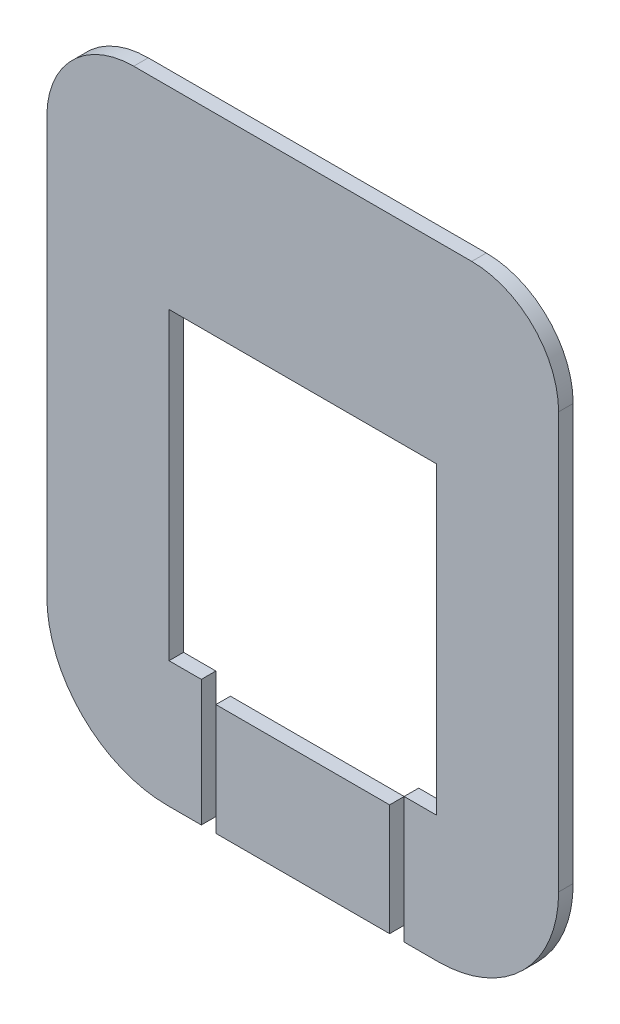
ISO-10303-21;
HEADER;
FILE_DESCRIPTION(('STEP AP214'),'2;1');
FILE_NAME('part.step','',(''),(''),'','','');
FILE_SCHEMA(('AUTOMOTIVE_DESIGN { 1 0 10303 214 1 1 1 1 }'));
ENDSEC;
DATA;
#1=APPLICATION_CONTEXT('core data for automotive mechanical design processes');
#2=APPLICATION_PROTOCOL_DEFINITION('international standard','automotive_design',2000,#1);
#3=PRODUCT_CONTEXT('',#1,'mechanical');
#4=PRODUCT('Part','Part','',(#3));
#5=PRODUCT_RELATED_PRODUCT_CATEGORY('part','',(#4));
#6=PRODUCT_DEFINITION_FORMATION('','',#4);
#7=PRODUCT_DEFINITION_CONTEXT('part definition',#1,'design');
#8=PRODUCT_DEFINITION('design','',#6,#7);
#9=PRODUCT_DEFINITION_SHAPE('','',#8);
#10=(LENGTH_UNIT() NAMED_UNIT(*) SI_UNIT(.MILLI.,.METRE.));
#11=(NAMED_UNIT(*) PLANE_ANGLE_UNIT() SI_UNIT($,.RADIAN.));
#12=(NAMED_UNIT(*) SI_UNIT($,.STERADIAN.) SOLID_ANGLE_UNIT());
#13=UNCERTAINTY_MEASURE_WITH_UNIT(LENGTH_MEASURE(1.E-05),#10,'distance_accuracy_value','');
#14=(GEOMETRIC_REPRESENTATION_CONTEXT(3) GLOBAL_UNCERTAINTY_ASSIGNED_CONTEXT((#13)) GLOBAL_UNIT_ASSIGNED_CONTEXT((#10,
#11,#12)) REPRESENTATION_CONTEXT('',''));
#15=CARTESIAN_POINT('',(0.,0.,0.));
#16=DIRECTION('',(0.,0.,1.));
#17=DIRECTION('',(1.,0.,0.));
#18=AXIS2_PLACEMENT_3D('',#15,#16,#17);
#19=CARTESIAN_POINT('',(-40.,-92.2,4.3));
#20=DIRECTION('',(0.,1.,0.));
#21=DIRECTION('',(-1.,0.,0.));
#22=AXIS2_PLACEMENT_3D('',#19,#20,#21);
#23=PLANE('',#22);
#24=DIRECTION('',(0.,0.,1.));
#25=VECTOR('',#24,1.);
#26=CARTESIAN_POINT('',(30.,-92.2,-5.7));
#27=LINE('',#26,#25);
#28=CARTESIAN_POINT('',(30.,-92.2,0.));
#29=VERTEX_POINT('',#28);
#30=CARTESIAN_POINT('',(30.,-92.2,4.3));
#31=VERTEX_POINT('',#30);
#32=EDGE_CURVE('E292',#29,#31,#27,.T.);
#33=ORIENTED_EDGE('',*,*,#32,.F.);
#34=DIRECTION('',(1.,0.,0.));
#35=VECTOR('',#34,1.);
#36=CARTESIAN_POINT('',(-40.,-92.2,0.));
#37=LINE('',#36,#35);
#38=CARTESIAN_POINT('',(40.,-92.2,0.));
#39=VERTEX_POINT('',#38);
#40=EDGE_CURVE('E302',#29,#39,#37,.T.);
#41=ORIENTED_EDGE('',*,*,#40,.T.);
#42=DIRECTION('',(0.,0.,-1.));
#43=VECTOR('',#42,1.);
#44=CARTESIAN_POINT('',(40.,-92.2,4.3));
#45=LINE('',#44,#43);
#46=CARTESIAN_POINT('',(40.,-92.2,4.3));
#47=VERTEX_POINT('',#46);
#48=EDGE_CURVE('E203',#47,#39,#45,.T.);
#49=ORIENTED_EDGE('',*,*,#48,.F.);
#50=DIRECTION('',(1.,0.,0.));
#51=VECTOR('',#50,1.);
#52=CARTESIAN_POINT('',(-0.49999999999998,-92.2,4.3));
#53=LINE('',#52,#51);
#54=EDGE_CURVE('E281',#31,#47,#53,.T.);
#55=ORIENTED_EDGE('',*,*,#54,.F.);
#56=EDGE_LOOP('',(#33,#41,#49,#55));
#57=FACE_BOUND('',#56,.T.);
#58=ADVANCED_FACE('F48',(#57),#23,.F.);
#59=CARTESIAN_POINT('',(40.,-56.5,4.3));
#60=DIRECTION('',(0.,0.,1.));
#61=DIRECTION('',(1.,0.,0.));
#62=AXIS2_PLACEMENT_3D('',#59,#60,#61);
#63=PLANE('',#62);
#64=DIRECTION('',(1.,0.,0.));
#65=VECTOR('',#64,1.);
#66=CARTESIAN_POINT('',(0.,-54.89,4.3));
#67=LINE('',#66,#65);
#68=CARTESIAN_POINT('',(30.,-54.89,4.3));
#69=VERTEX_POINT('',#68);
#70=CARTESIAN_POINT('',(39.555,-54.89,4.3));
#71=VERTEX_POINT('',#70);
#72=EDGE_CURVE('E202',#69,#71,#67,.T.);
#73=ORIENTED_EDGE('',*,*,#72,.F.);
#74=DIRECTION('',(0.,-1.,0.));
#75=VECTOR('',#74,1.);
#76=CARTESIAN_POINT('',(30.,0.,4.3));
#77=LINE('',#76,#75);
#78=EDGE_CURVE('E298',#69,#31,#77,.T.);
#79=ORIENTED_EDGE('',*,*,#78,.T.);
#80=ORIENTED_EDGE('',*,*,#54,.T.);
#81=CARTESIAN_POINT('',(40.,-56.5,4.3));
#82=DIRECTION('',(0.,0.,1.));
#83=DIRECTION('',(1.,0.,0.));
#84=AXIS2_PLACEMENT_3D('',#81,#82,#83);
#85=CIRCLE('',#84,35.7);
#86=CARTESIAN_POINT('',(75.7,-56.5,4.3));
#87=VERTEX_POINT('',#86);
#88=EDGE_CURVE('E278',#47,#87,#85,.T.);
#89=ORIENTED_EDGE('',*,*,#88,.T.);
#90=DIRECTION('',(0.,1.,0.));
#91=VECTOR('',#90,1.);
#92=CARTESIAN_POINT('',(75.7,66.5,4.3));
#93=LINE('',#92,#91);
#94=CARTESIAN_POINT('',(75.7,66.5,4.3));
#95=VERTEX_POINT('',#94);
#96=EDGE_CURVE('E275',#87,#95,#93,.T.);
#97=ORIENTED_EDGE('',*,*,#96,.T.);
#98=CARTESIAN_POINT('',(50.,66.5,4.3));
#99=DIRECTION('',(0.,0.,1.));
#100=DIRECTION('',(-1.,0.,0.));
#101=AXIS2_PLACEMENT_3D('',#98,#99,#100);
#102=CIRCLE('',#101,25.7);
#103=CARTESIAN_POINT('',(50.,92.2,4.3));
#104=VERTEX_POINT('',#103);
#105=EDGE_CURVE('E272',#95,#104,#102,.T.);
#106=ORIENTED_EDGE('',*,*,#105,.T.);
#107=DIRECTION('',(-1.,0.,0.));
#108=VECTOR('',#107,1.);
#109=CARTESIAN_POINT('',(-50.,92.2,4.3));
#110=LINE('',#109,#108);
#111=CARTESIAN_POINT('',(-50.,92.2,4.3));
#112=VERTEX_POINT('',#111);
#113=EDGE_CURVE('E269',#104,#112,#110,.T.);
#114=ORIENTED_EDGE('',*,*,#113,.T.);
#115=CARTESIAN_POINT('',(-50.,66.5,4.3));
#116=DIRECTION('',(0.,0.,1.));
#117=DIRECTION('',(-1.,0.,0.));
#118=AXIS2_PLACEMENT_3D('',#115,#116,#117);
#119=CIRCLE('',#118,25.7);
#120=CARTESIAN_POINT('',(-75.7,66.5,4.3));
#121=VERTEX_POINT('',#120);
#122=EDGE_CURVE('E266',#112,#121,#119,.T.);
#123=ORIENTED_EDGE('',*,*,#122,.T.);
#124=DIRECTION('',(0.,-1.,0.));
#125=VECTOR('',#124,1.);
#126=CARTESIAN_POINT('',(-75.7,66.5,4.3));
#127=LINE('',#126,#125);
#128=CARTESIAN_POINT('',(-75.7,-56.5,4.3));
#129=VERTEX_POINT('',#128);
#130=EDGE_CURVE('E263',#121,#129,#127,.T.);
#131=ORIENTED_EDGE('',*,*,#130,.T.);
#132=CARTESIAN_POINT('',(-40.,-56.5,4.3));
#133=DIRECTION('',(0.,0.,1.));
#134=DIRECTION('',(1.,0.,0.));
#135=AXIS2_PLACEMENT_3D('',#132,#133,#134);
#136=CIRCLE('',#135,35.7);
#137=CARTESIAN_POINT('',(-40.,-92.2,4.3));
#138=VERTEX_POINT('',#137);
#139=EDGE_CURVE('E258',#129,#138,#136,.T.);
#140=ORIENTED_EDGE('',*,*,#139,.T.);
#141=CARTESIAN_POINT('',(-30.,-92.2,4.3));
#142=VERTEX_POINT('',#141);
#143=EDGE_CURVE('E262',#138,#142,#53,.T.);
#144=ORIENTED_EDGE('',*,*,#143,.T.);
#145=DIRECTION('',(0.,-1.,0.));
#146=VECTOR('',#145,1.);
#147=CARTESIAN_POINT('',(-30.,0.,4.3));
#148=LINE('',#147,#146);
#149=CARTESIAN_POINT('',(-30.,-54.89,4.3));
#150=VERTEX_POINT('',#149);
#151=EDGE_CURVE('E288',#150,#142,#148,.T.);
#152=ORIENTED_EDGE('',*,*,#151,.F.);
#153=CARTESIAN_POINT('',(-39.555,-54.89,4.3));
#154=VERTEX_POINT('',#153);
#155=EDGE_CURVE('E184',#154,#150,#67,.T.);
#156=ORIENTED_EDGE('',*,*,#155,.F.);
#157=DIRECTION('',(0.,-1.,0.));
#158=VECTOR('',#157,1.);
#159=CARTESIAN_POINT('',(-39.555,0.,4.3));
#160=LINE('',#159,#158);
#161=CARTESIAN_POINT('',(-39.555,35.11,4.3));
#162=VERTEX_POINT('',#161);
#163=EDGE_CURVE('E181',#162,#154,#160,.T.);
#164=ORIENTED_EDGE('',*,*,#163,.F.);
#165=DIRECTION('',(1.,0.,0.));
#166=VECTOR('',#165,1.);
#167=CARTESIAN_POINT('',(0.,35.11,4.3));
#168=LINE('',#167,#166);
#169=CARTESIAN_POINT('',(39.555,35.11,4.3));
#170=VERTEX_POINT('',#169);
#171=EDGE_CURVE('E309',#162,#170,#168,.T.);
#172=ORIENTED_EDGE('',*,*,#171,.T.);
#173=DIRECTION('',(0.,-1.,0.));
#174=VECTOR('',#173,1.);
#175=CARTESIAN_POINT('',(39.555,0.,4.3));
#176=LINE('',#175,#174);
#177=EDGE_CURVE('E195',#170,#71,#176,.T.);
#178=ORIENTED_EDGE('',*,*,#177,.T.);
#179=EDGE_LOOP('',(#73,#79,#80,#89,#97,#106,#114,#123,#131,#140,#144,#152,#156,#164,#172,#178));
#180=FACE_BOUND('',#179,.T.);
#181=ADVANCED_FACE('F323',(#180),#63,.T.);
#182=CARTESIAN_POINT('',(40.,-56.5,0.));
#183=DIRECTION('',(0.,0.,1.));
#184=DIRECTION('',(1.,0.,0.));
#185=AXIS2_PLACEMENT_3D('',#182,#183,#184);
#186=PLANE('',#185);
#187=DIRECTION('',(0.,-1.,0.));
#188=VECTOR('',#187,1.);
#189=CARTESIAN_POINT('',(30.,-56.5,0.));
#190=LINE('',#189,#188);
#191=CARTESIAN_POINT('',(30.,-54.89,0.));
#192=VERTEX_POINT('',#191);
#193=EDGE_CURVE('E242',#192,#29,#190,.T.);
#194=ORIENTED_EDGE('',*,*,#193,.F.);
#195=DIRECTION('',(1.,0.,0.));
#196=VECTOR('',#195,1.);
#197=CARTESIAN_POINT('',(40.,-54.89,0.));
#198=LINE('',#197,#196);
#199=CARTESIAN_POINT('',(39.555,-54.89,0.));
#200=VERTEX_POINT('',#199);
#201=EDGE_CURVE('E191',#192,#200,#198,.T.);
#202=ORIENTED_EDGE('',*,*,#201,.T.);
#203=DIRECTION('',(0.,-1.,0.));
#204=VECTOR('',#203,1.);
#205=CARTESIAN_POINT('',(39.555,-56.5,0.));
#206=LINE('',#205,#204);
#207=CARTESIAN_POINT('',(39.555,35.11,0.));
#208=VERTEX_POINT('',#207);
#209=EDGE_CURVE('E59',#208,#200,#206,.T.);
#210=ORIENTED_EDGE('',*,*,#209,.F.);
#211=DIRECTION('',(1.,0.,0.));
#212=VECTOR('',#211,1.);
#213=CARTESIAN_POINT('',(40.,35.11,0.));
#214=LINE('',#213,#212);
#215=CARTESIAN_POINT('',(-39.555,35.11,0.));
#216=VERTEX_POINT('',#215);
#217=EDGE_CURVE('E189',#216,#208,#214,.T.);
#218=ORIENTED_EDGE('',*,*,#217,.F.);
#219=DIRECTION('',(0.,-1.,0.));
#220=VECTOR('',#219,1.);
#221=CARTESIAN_POINT('',(-39.555,-56.5,0.));
#222=LINE('',#221,#220);
#223=CARTESIAN_POINT('',(-39.555,-54.89,0.));
#224=VERTEX_POINT('',#223);
#225=EDGE_CURVE('E176',#216,#224,#222,.T.);
#226=ORIENTED_EDGE('',*,*,#225,.T.);
#227=DIRECTION('',(1.,0.,0.));
#228=VECTOR('',#227,1.);
#229=CARTESIAN_POINT('',(40.,-54.89,0.));
#230=LINE('',#229,#228);
#231=CARTESIAN_POINT('',(-30.,-54.89,0.));
#232=VERTEX_POINT('',#231);
#233=EDGE_CURVE('E165',#224,#232,#230,.T.);
#234=ORIENTED_EDGE('',*,*,#233,.T.);
#235=DIRECTION('',(0.,-1.,0.));
#236=VECTOR('',#235,1.);
#237=CARTESIAN_POINT('',(-30.,-56.5,0.));
#238=LINE('',#237,#236);
#239=CARTESIAN_POINT('',(-30.,-92.2,0.));
#240=VERTEX_POINT('',#239);
#241=EDGE_CURVE('E175',#232,#240,#238,.T.);
#242=ORIENTED_EDGE('',*,*,#241,.T.);
#243=CARTESIAN_POINT('',(-40.,-92.2,0.));
#244=VERTEX_POINT('',#243);
#245=EDGE_CURVE('E52',#244,#240,#37,.T.);
#246=ORIENTED_EDGE('',*,*,#245,.F.);
#247=CARTESIAN_POINT('',(-40.,-56.5,0.));
#248=DIRECTION('',(0.,0.,1.));
#249=DIRECTION('',(1.,0.,0.));
#250=AXIS2_PLACEMENT_3D('',#247,#248,#249);
#251=CIRCLE('',#250,35.7);
#252=CARTESIAN_POINT('',(-75.7,-56.5,0.));
#253=VERTEX_POINT('',#252);
#254=EDGE_CURVE('E233',#253,#244,#251,.T.);
#255=ORIENTED_EDGE('',*,*,#254,.F.);
#256=DIRECTION('',(0.,-1.,0.));
#257=VECTOR('',#256,1.);
#258=CARTESIAN_POINT('',(-75.7,66.5,0.));
#259=LINE('',#258,#257);
#260=CARTESIAN_POINT('',(-75.7,66.5,0.));
#261=VERTEX_POINT('',#260);
#262=EDGE_CURVE('E228',#261,#253,#259,.T.);
#263=ORIENTED_EDGE('',*,*,#262,.F.);
#264=CARTESIAN_POINT('',(-50.,66.5,0.));
#265=DIRECTION('',(0.,0.,1.));
#266=DIRECTION('',(-1.,0.,0.));
#267=AXIS2_PLACEMENT_3D('',#264,#265,#266);
#268=CIRCLE('',#267,25.7);
#269=CARTESIAN_POINT('',(-50.,92.2,0.));
#270=VERTEX_POINT('',#269);
#271=EDGE_CURVE('E223',#270,#261,#268,.T.);
#272=ORIENTED_EDGE('',*,*,#271,.F.);
#273=DIRECTION('',(-1.,0.,0.));
#274=VECTOR('',#273,1.);
#275=CARTESIAN_POINT('',(-50.,92.2,0.));
#276=LINE('',#275,#274);
#277=CARTESIAN_POINT('',(50.,92.2,0.));
#278=VERTEX_POINT('',#277);
#279=EDGE_CURVE('E218',#278,#270,#276,.T.);
#280=ORIENTED_EDGE('',*,*,#279,.F.);
#281=CARTESIAN_POINT('',(50.,66.5,0.));
#282=DIRECTION('',(0.,0.,1.));
#283=DIRECTION('',(-1.,0.,0.));
#284=AXIS2_PLACEMENT_3D('',#281,#282,#283);
#285=CIRCLE('',#284,25.7);
#286=CARTESIAN_POINT('',(75.7,66.5,0.));
#287=VERTEX_POINT('',#286);
#288=EDGE_CURVE('E213',#287,#278,#285,.T.);
#289=ORIENTED_EDGE('',*,*,#288,.F.);
#290=DIRECTION('',(0.,1.,0.));
#291=VECTOR('',#290,1.);
#292=CARTESIAN_POINT('',(75.7,66.5,0.));
#293=LINE('',#292,#291);
#294=CARTESIAN_POINT('',(75.7,-56.5,0.));
#295=VERTEX_POINT('',#294);
#296=EDGE_CURVE('E207',#295,#287,#293,.T.);
#297=ORIENTED_EDGE('',*,*,#296,.F.);
#298=CARTESIAN_POINT('',(40.,-56.5,0.));
#299=DIRECTION('',(0.,0.,1.));
#300=DIRECTION('',(1.,0.,0.));
#301=AXIS2_PLACEMENT_3D('',#298,#299,#300);
#302=CIRCLE('',#301,35.7);
#303=EDGE_CURVE('E208',#39,#295,#302,.T.);
#304=ORIENTED_EDGE('',*,*,#303,.F.);
#305=ORIENTED_EDGE('',*,*,#40,.F.);
#306=EDGE_LOOP('',(#194,#202,#210,#218,#226,#234,#242,#246,#255,#263,#272,#280,#289,#297,#304,#305));
#307=FACE_BOUND('',#306,.T.);
#308=ADVANCED_FACE('F187',(#307),#186,.F.);
#309=CARTESIAN_POINT('',(40.,-56.5,4.3));
#310=DIRECTION('',(0.,0.,-1.));
#311=DIRECTION('',(-1.,0.,0.));
#312=AXIS2_PLACEMENT_3D('',#309,#310,#311);
#313=CYLINDRICAL_SURFACE('',#312,35.7);
#314=ORIENTED_EDGE('',*,*,#303,.T.);
#315=DIRECTION('',(0.,0.,-1.));
#316=VECTOR('',#315,1.);
#317=CARTESIAN_POINT('',(75.7,-56.5,4.3));
#318=LINE('',#317,#316);
#319=EDGE_CURVE('E209',#87,#295,#318,.T.);
#320=ORIENTED_EDGE('',*,*,#319,.F.);
#321=ORIENTED_EDGE('',*,*,#88,.F.);
#322=ORIENTED_EDGE('',*,*,#48,.T.);
#323=EDGE_LOOP('',(#314,#320,#321,#322));
#324=FACE_BOUND('',#323,.T.);
#325=ADVANCED_FACE('F332',(#324),#313,.T.);
#326=CARTESIAN_POINT('',(75.7,66.5,4.3));
#327=DIRECTION('',(-1.,0.,0.));
#328=DIRECTION('',(0.,-1.,0.));
#329=AXIS2_PLACEMENT_3D('',#326,#327,#328);
#330=PLANE('',#329);
#331=ORIENTED_EDGE('',*,*,#296,.T.);
#332=DIRECTION('',(0.,0.,-1.));
#333=VECTOR('',#332,1.);
#334=CARTESIAN_POINT('',(75.7,66.5,4.3));
#335=LINE('',#334,#333);
#336=EDGE_CURVE('E214',#95,#287,#335,.T.);
#337=ORIENTED_EDGE('',*,*,#336,.F.);
#338=ORIENTED_EDGE('',*,*,#96,.F.);
#339=ORIENTED_EDGE('',*,*,#319,.T.);
#340=EDGE_LOOP('',(#331,#337,#338,#339));
#341=FACE_BOUND('',#340,.T.);
#342=ADVANCED_FACE('F337',(#341),#330,.F.);
#343=CARTESIAN_POINT('',(50.,66.5,4.3));
#344=DIRECTION('',(0.,0.,-1.));
#345=DIRECTION('',(-1.,0.,0.));
#346=AXIS2_PLACEMENT_3D('',#343,#344,#345);
#347=CYLINDRICAL_SURFACE('',#346,25.7);
#348=ORIENTED_EDGE('',*,*,#288,.T.);
#349=DIRECTION('',(0.,0.,-1.));
#350=VECTOR('',#349,1.);
#351=CARTESIAN_POINT('',(50.,92.2,4.3));
#352=LINE('',#351,#350);
#353=EDGE_CURVE('E219',#104,#278,#352,.T.);
#354=ORIENTED_EDGE('',*,*,#353,.F.);
#355=ORIENTED_EDGE('',*,*,#105,.F.);
#356=ORIENTED_EDGE('',*,*,#336,.T.);
#357=EDGE_LOOP('',(#348,#354,#355,#356));
#358=FACE_BOUND('',#357,.T.);
#359=ADVANCED_FACE('F343',(#358),#347,.T.);
#360=CARTESIAN_POINT('',(-50.,92.2,4.3));
#361=DIRECTION('',(0.,-1.,0.));
#362=DIRECTION('',(0.,0.,-1.));
#363=AXIS2_PLACEMENT_3D('',#360,#361,#362);
#364=PLANE('',#363);
#365=ORIENTED_EDGE('',*,*,#279,.T.);
#366=DIRECTION('',(0.,0.,-1.));
#367=VECTOR('',#366,1.);
#368=CARTESIAN_POINT('',(-50.,92.2,4.3));
#369=LINE('',#368,#367);
#370=EDGE_CURVE('E224',#112,#270,#369,.T.);
#371=ORIENTED_EDGE('',*,*,#370,.F.);
#372=ORIENTED_EDGE('',*,*,#113,.F.);
#373=ORIENTED_EDGE('',*,*,#353,.T.);
#374=EDGE_LOOP('',(#365,#371,#372,#373));
#375=FACE_BOUND('',#374,.T.);
#376=ADVANCED_FACE('F347',(#375),#364,.F.);
#377=CARTESIAN_POINT('',(-50.,66.5,4.3));
#378=DIRECTION('',(0.,0.,-1.));
#379=DIRECTION('',(-1.,0.,0.));
#380=AXIS2_PLACEMENT_3D('',#377,#378,#379);
#381=CYLINDRICAL_SURFACE('',#380,25.7);
#382=ORIENTED_EDGE('',*,*,#271,.T.);
#383=DIRECTION('',(0.,0.,-1.));
#384=VECTOR('',#383,1.);
#385=CARTESIAN_POINT('',(-75.7,66.5,4.3));
#386=LINE('',#385,#384);
#387=EDGE_CURVE('E229',#121,#261,#386,.T.);
#388=ORIENTED_EDGE('',*,*,#387,.F.);
#389=ORIENTED_EDGE('',*,*,#122,.F.);
#390=ORIENTED_EDGE('',*,*,#370,.T.);
#391=EDGE_LOOP('',(#382,#388,#389,#390));
#392=FACE_BOUND('',#391,.T.);
#393=ADVANCED_FACE('F352',(#392),#381,.T.);
#394=CARTESIAN_POINT('',(-75.7,66.5,4.3));
#395=DIRECTION('',(1.,0.,0.));
#396=DIRECTION('',(0.,1.,0.));
#397=AXIS2_PLACEMENT_3D('',#394,#395,#396);
#398=PLANE('',#397);
#399=ORIENTED_EDGE('',*,*,#262,.T.);
#400=DIRECTION('',(0.,0.,-1.));
#401=VECTOR('',#400,1.);
#402=CARTESIAN_POINT('',(-75.7,-56.5,4.3));
#403=LINE('',#402,#401);
#404=EDGE_CURVE('E234',#129,#253,#403,.T.);
#405=ORIENTED_EDGE('',*,*,#404,.F.);
#406=ORIENTED_EDGE('',*,*,#130,.F.);
#407=ORIENTED_EDGE('',*,*,#387,.T.);
#408=EDGE_LOOP('',(#399,#405,#406,#407));
#409=FACE_BOUND('',#408,.T.);
#410=ADVANCED_FACE('F358',(#409),#398,.F.);
#411=CARTESIAN_POINT('',(-40.,-56.5,4.3));
#412=DIRECTION('',(0.,0.,-1.));
#413=DIRECTION('',(-1.,0.,0.));
#414=AXIS2_PLACEMENT_3D('',#411,#412,#413);
#415=CYLINDRICAL_SURFACE('',#414,35.7);
#416=ORIENTED_EDGE('',*,*,#254,.T.);
#417=DIRECTION('',(0.,0.,-1.));
#418=VECTOR('',#417,1.);
#419=CARTESIAN_POINT('',(-40.,-92.2,4.3));
#420=LINE('',#419,#418);
#421=EDGE_CURVE('E238',#138,#244,#420,.T.);
#422=ORIENTED_EDGE('',*,*,#421,.F.);
#423=ORIENTED_EDGE('',*,*,#139,.F.);
#424=ORIENTED_EDGE('',*,*,#404,.T.);
#425=EDGE_LOOP('',(#416,#422,#423,#424));
#426=FACE_BOUND('',#425,.T.);
#427=ADVANCED_FACE('F362',(#426),#415,.T.);
#428=ORIENTED_EDGE('',*,*,#245,.T.);
#429=DIRECTION('',(0.,0.,1.));
#430=VECTOR('',#429,1.);
#431=CARTESIAN_POINT('',(-30.,-92.2,-5.7));
#432=LINE('',#431,#430);
#433=EDGE_CURVE('E243',#240,#142,#432,.T.);
#434=ORIENTED_EDGE('',*,*,#433,.T.);
#435=ORIENTED_EDGE('',*,*,#143,.F.);
#436=ORIENTED_EDGE('',*,*,#421,.T.);
#437=EDGE_LOOP('',(#428,#434,#435,#436));
#438=FACE_BOUND('',#437,.T.);
#439=ADVANCED_FACE('F50',(#438),#23,.F.);
#440=CARTESIAN_POINT('',(30.,0.,-5.7));
#441=DIRECTION('',(-1.,0.,0.));
#442=DIRECTION('',(0.,0.,1.));
#443=AXIS2_PLACEMENT_3D('',#440,#441,#442);
#444=PLANE('',#443);
#445=ORIENTED_EDGE('',*,*,#193,.T.);
#446=ORIENTED_EDGE('',*,*,#32,.T.);
#447=ORIENTED_EDGE('',*,*,#78,.F.);
#448=DIRECTION('',(0.,0.,1.));
#449=VECTOR('',#448,1.);
#450=CARTESIAN_POINT('',(30.,-54.89,-5.7));
#451=LINE('',#450,#449);
#452=EDGE_CURVE('E295',#192,#69,#451,.T.);
#453=ORIENTED_EDGE('',*,*,#452,.F.);
#454=EDGE_LOOP('',(#445,#446,#447,#453));
#455=FACE_BOUND('',#454,.T.);
#456=ADVANCED_FACE('F375',(#455),#444,.T.);
#457=CARTESIAN_POINT('',(0.,-54.89,-5.7));
#458=DIRECTION('',(0.,-1.,0.));
#459=DIRECTION('',(0.,0.,-1.));
#460=AXIS2_PLACEMENT_3D('',#457,#458,#459);
#461=PLANE('',#460);
#462=ORIENTED_EDGE('',*,*,#452,.T.);
#463=ORIENTED_EDGE('',*,*,#72,.T.);
#464=DIRECTION('',(0.,0.,1.));
#465=VECTOR('',#464,1.);
#466=CARTESIAN_POINT('',(39.555,-54.89,-5.7));
#467=LINE('',#466,#465);
#468=EDGE_CURVE('E12',#200,#71,#467,.T.);
#469=ORIENTED_EDGE('',*,*,#468,.F.);
#470=ORIENTED_EDGE('',*,*,#201,.F.);
#471=EDGE_LOOP('',(#462,#463,#469,#470));
#472=FACE_BOUND('',#471,.T.);
#473=ADVANCED_FACE('F377',(#472),#461,.F.);
#474=CARTESIAN_POINT('',(0.,35.11,-5.7));
#475=DIRECTION('',(0.,-1.,0.));
#476=DIRECTION('',(0.,0.,-1.));
#477=AXIS2_PLACEMENT_3D('',#474,#475,#476);
#478=PLANE('',#477);
#479=ORIENTED_EDGE('',*,*,#217,.T.);
#480=DIRECTION('',(0.,0.,1.));
#481=VECTOR('',#480,1.);
#482=CARTESIAN_POINT('',(39.555,35.11,-5.7));
#483=LINE('',#482,#481);
#484=EDGE_CURVE('E201',#208,#170,#483,.T.);
#485=ORIENTED_EDGE('',*,*,#484,.T.);
#486=ORIENTED_EDGE('',*,*,#171,.F.);
#487=DIRECTION('',(0.,0.,1.));
#488=VECTOR('',#487,1.);
#489=CARTESIAN_POINT('',(-39.555,35.11,-5.7));
#490=LINE('',#489,#488);
#491=EDGE_CURVE('E99',#216,#162,#490,.T.);
#492=ORIENTED_EDGE('',*,*,#491,.F.);
#493=EDGE_LOOP('',(#479,#485,#486,#492));
#494=FACE_BOUND('',#493,.T.);
#495=ADVANCED_FACE('F381',(#494),#478,.T.);
#496=CARTESIAN_POINT('',(-39.555,0.,-5.7));
#497=DIRECTION('',(-1.,0.,0.));
#498=DIRECTION('',(0.,-1.,0.));
#499=AXIS2_PLACEMENT_3D('',#496,#497,#498);
#500=PLANE('',#499);
#501=ORIENTED_EDGE('',*,*,#491,.T.);
#502=ORIENTED_EDGE('',*,*,#163,.T.);
#503=DIRECTION('',(0.,0.,1.));
#504=VECTOR('',#503,1.);
#505=CARTESIAN_POINT('',(-39.555,-54.89,-5.7));
#506=LINE('',#505,#504);
#507=EDGE_CURVE('E169',#224,#154,#506,.T.);
#508=ORIENTED_EDGE('',*,*,#507,.F.);
#509=ORIENTED_EDGE('',*,*,#225,.F.);
#510=EDGE_LOOP('',(#501,#502,#508,#509));
#511=FACE_BOUND('',#510,.T.);
#512=ADVANCED_FACE('F178',(#511),#500,.F.);
#513=ORIENTED_EDGE('',*,*,#507,.T.);
#514=ORIENTED_EDGE('',*,*,#155,.T.);
#515=DIRECTION('',(0.,0.,1.));
#516=VECTOR('',#515,1.);
#517=CARTESIAN_POINT('',(-30.,-54.89,-5.7));
#518=LINE('',#517,#516);
#519=EDGE_CURVE('E170',#232,#150,#518,.T.);
#520=ORIENTED_EDGE('',*,*,#519,.F.);
#521=ORIENTED_EDGE('',*,*,#233,.F.);
#522=EDGE_LOOP('',(#513,#514,#520,#521));
#523=FACE_BOUND('',#522,.T.);
#524=ADVANCED_FACE('F167',(#523),#461,.F.);
#525=CARTESIAN_POINT('',(-30.,0.,-5.7));
#526=DIRECTION('',(-1.,0.,0.));
#527=DIRECTION('',(0.,0.,1.));
#528=AXIS2_PLACEMENT_3D('',#525,#526,#527);
#529=PLANE('',#528);
#530=ORIENTED_EDGE('',*,*,#519,.T.);
#531=ORIENTED_EDGE('',*,*,#151,.T.);
#532=ORIENTED_EDGE('',*,*,#433,.F.);
#533=ORIENTED_EDGE('',*,*,#241,.F.);
#534=EDGE_LOOP('',(#530,#531,#532,#533));
#535=FACE_BOUND('',#534,.T.);
#536=ADVANCED_FACE('F383',(#535),#529,.F.);
#537=CARTESIAN_POINT('',(39.555,0.,-5.7));
#538=DIRECTION('',(-1.,0.,0.));
#539=DIRECTION('',(0.,-1.,0.));
#540=AXIS2_PLACEMENT_3D('',#537,#538,#539);
#541=PLANE('',#540);
#542=ORIENTED_EDGE('',*,*,#209,.T.);
#543=ORIENTED_EDGE('',*,*,#468,.T.);
#544=ORIENTED_EDGE('',*,*,#177,.F.);
#545=ORIENTED_EDGE('',*,*,#484,.F.);
#546=EDGE_LOOP('',(#542,#543,#544,#545));
#547=FACE_BOUND('',#546,.T.);
#548=ADVANCED_FACE('F380',(#547),#541,.T.);
#549=CLOSED_SHELL('',(#58,#181,#308,#325,#342,#359,#376,#393,#410,#427,#439,#456,#473,#495,#512,
#524,#536,#548));
#550=MANIFOLD_SOLID_BREP('B2',#549);
#551=CARTESIAN_POINT('',(40.,-56.5,4.3));
#552=DIRECTION('',(0.,0.,1.));
#553=DIRECTION('',(1.,0.,0.));
#554=AXIS2_PLACEMENT_3D('',#551,#552,#553);
#555=PLANE('',#554);
#556=DIRECTION('',(0.,-1.,0.));
#557=VECTOR('',#556,1.);
#558=CARTESIAN_POINT('',(25.7,0.,4.3));
#559=LINE('',#558,#557);
#560=CARTESIAN_POINT('',(25.7,-59.19,4.3));
#561=VERTEX_POINT('',#560);
#562=CARTESIAN_POINT('',(25.7,-92.2,4.3));
#563=VERTEX_POINT('',#562);
#564=EDGE_CURVE('E599',#561,#563,#559,.T.);
#565=ORIENTED_EDGE('',*,*,#564,.F.);
#566=DIRECTION('',(1.,0.,0.));
#567=VECTOR('',#566,1.);
#568=CARTESIAN_POINT('',(0.,-59.19,4.3));
#569=LINE('',#568,#567);
#570=CARTESIAN_POINT('',(-25.7,-59.19,4.3));
#571=VERTEX_POINT('',#570);
#572=EDGE_CURVE('E606',#571,#561,#569,.T.);
#573=ORIENTED_EDGE('',*,*,#572,.F.);
#574=DIRECTION('',(0.,-1.,0.));
#575=VECTOR('',#574,1.);
#576=CARTESIAN_POINT('',(-25.7,0.,4.3));
#577=LINE('',#576,#575);
#578=CARTESIAN_POINT('',(-25.7,-92.2,4.3));
#579=VERTEX_POINT('',#578);
#580=EDGE_CURVE('E591',#571,#579,#577,.T.);
#581=ORIENTED_EDGE('',*,*,#580,.T.);
#582=DIRECTION('',(1.,0.,0.));
#583=VECTOR('',#582,1.);
#584=CARTESIAN_POINT('',(-0.49999999999998,-92.2,4.3));
#585=LINE('',#584,#583);
#586=EDGE_CURVE('E604',#579,#563,#585,.T.);
#587=ORIENTED_EDGE('',*,*,#586,.T.);
#588=EDGE_LOOP('',(#565,#573,#581,#587));
#589=FACE_BOUND('',#588,.T.);
#590=ADVANCED_FACE('F550',(#589),#555,.T.);
#591=CARTESIAN_POINT('',(40.,-56.5,0.));
#592=DIRECTION('',(0.,0.,1.));
#593=DIRECTION('',(1.,0.,0.));
#594=AXIS2_PLACEMENT_3D('',#591,#592,#593);
#595=PLANE('',#594);
#596=DIRECTION('',(1.,0.,0.));
#597=VECTOR('',#596,1.);
#598=CARTESIAN_POINT('',(40.,-59.19,0.));
#599=LINE('',#598,#597);
#600=CARTESIAN_POINT('',(-25.7,-59.19,0.));
#601=VERTEX_POINT('',#600);
#602=CARTESIAN_POINT('',(25.7,-59.19,0.));
#603=VERTEX_POINT('',#602);
#604=EDGE_CURVE('E558',#601,#603,#599,.T.);
#605=ORIENTED_EDGE('',*,*,#604,.T.);
#606=DIRECTION('',(0.,-1.,0.));
#607=VECTOR('',#606,1.);
#608=CARTESIAN_POINT('',(25.7,-56.5,0.));
#609=LINE('',#608,#607);
#610=CARTESIAN_POINT('',(25.7,-92.2,0.));
#611=VERTEX_POINT('',#610);
#612=EDGE_CURVE('E46',#603,#611,#609,.T.);
#613=ORIENTED_EDGE('',*,*,#612,.T.);
#614=DIRECTION('',(1.,0.,0.));
#615=VECTOR('',#614,1.);
#616=CARTESIAN_POINT('',(-40.,-92.2,0.));
#617=LINE('',#616,#615);
#618=CARTESIAN_POINT('',(-25.7,-92.2,0.));
#619=VERTEX_POINT('',#618);
#620=EDGE_CURVE('E608',#619,#611,#617,.T.);
#621=ORIENTED_EDGE('',*,*,#620,.F.);
#622=DIRECTION('',(0.,-1.,0.));
#623=VECTOR('',#622,1.);
#624=CARTESIAN_POINT('',(-25.7,-56.5,0.));
#625=LINE('',#624,#623);
#626=EDGE_CURVE('E594',#601,#619,#625,.T.);
#627=ORIENTED_EDGE('',*,*,#626,.F.);
#628=EDGE_LOOP('',(#605,#613,#621,#627));
#629=FACE_BOUND('',#628,.T.);
#630=ADVANCED_FACE('F615',(#629),#595,.F.);
#631=CARTESIAN_POINT('',(-40.,-92.2,4.3));
#632=DIRECTION('',(0.,1.,0.));
#633=DIRECTION('',(-1.,0.,0.));
#634=AXIS2_PLACEMENT_3D('',#631,#632,#633);
#635=PLANE('',#634);
#636=ORIENTED_EDGE('',*,*,#620,.T.);
#637=DIRECTION('',(0.,0.,1.));
#638=VECTOR('',#637,1.);
#639=CARTESIAN_POINT('',(25.7,-92.2,-5.7));
#640=LINE('',#639,#638);
#641=EDGE_CURVE('E573',#611,#563,#640,.T.);
#642=ORIENTED_EDGE('',*,*,#641,.T.);
#643=ORIENTED_EDGE('',*,*,#586,.F.);
#644=DIRECTION('',(0.,0.,1.));
#645=VECTOR('',#644,1.);
#646=CARTESIAN_POINT('',(-25.7,-92.2,-5.7));
#647=LINE('',#646,#645);
#648=EDGE_CURVE('E588',#619,#579,#647,.T.);
#649=ORIENTED_EDGE('',*,*,#648,.F.);
#650=EDGE_LOOP('',(#636,#642,#643,#649));
#651=FACE_BOUND('',#650,.T.);
#652=ADVANCED_FACE('F552',(#651),#635,.F.);
#653=CARTESIAN_POINT('',(25.7,0.,-5.7));
#654=DIRECTION('',(-1.,0.,0.));
#655=DIRECTION('',(0.,-1.,0.));
#656=AXIS2_PLACEMENT_3D('',#653,#654,#655);
#657=PLANE('',#656);
#658=DIRECTION('',(0.,0.,1.));
#659=VECTOR('',#658,1.);
#660=CARTESIAN_POINT('',(25.7,-59.19,-5.7));
#661=LINE('',#660,#659);
#662=EDGE_CURVE('E619',#603,#561,#661,.T.);
#663=ORIENTED_EDGE('',*,*,#662,.T.);
#664=ORIENTED_EDGE('',*,*,#564,.T.);
#665=ORIENTED_EDGE('',*,*,#641,.F.);
#666=ORIENTED_EDGE('',*,*,#612,.F.);
#667=EDGE_LOOP('',(#663,#664,#665,#666));
#668=FACE_BOUND('',#667,.T.);
#669=ADVANCED_FACE('F624',(#668),#657,.F.);
#670=CARTESIAN_POINT('',(0.,-59.19,-5.7));
#671=DIRECTION('',(0.,-1.,0.));
#672=DIRECTION('',(0.,0.,-1.));
#673=AXIS2_PLACEMENT_3D('',#670,#671,#672);
#674=PLANE('',#673);
#675=DIRECTION('',(0.,0.,1.));
#676=VECTOR('',#675,1.);
#677=CARTESIAN_POINT('',(-25.7,-59.19,-5.7));
#678=LINE('',#677,#676);
#679=EDGE_CURVE('E565',#601,#571,#678,.T.);
#680=ORIENTED_EDGE('',*,*,#679,.T.);
#681=ORIENTED_EDGE('',*,*,#572,.T.);
#682=ORIENTED_EDGE('',*,*,#662,.F.);
#683=ORIENTED_EDGE('',*,*,#604,.F.);
#684=EDGE_LOOP('',(#680,#681,#682,#683));
#685=FACE_BOUND('',#684,.T.);
#686=ADVANCED_FACE('F618',(#685),#674,.F.);
#687=CARTESIAN_POINT('',(-25.7,0.,-5.7));
#688=DIRECTION('',(-1.,0.,0.));
#689=DIRECTION('',(0.,-1.,0.));
#690=AXIS2_PLACEMENT_3D('',#687,#688,#689);
#691=PLANE('',#690);
#692=ORIENTED_EDGE('',*,*,#626,.T.);
#693=ORIENTED_EDGE('',*,*,#648,.T.);
#694=ORIENTED_EDGE('',*,*,#580,.F.);
#695=ORIENTED_EDGE('',*,*,#679,.F.);
#696=EDGE_LOOP('',(#692,#693,#694,#695));
#697=FACE_BOUND('',#696,.T.);
#698=ADVANCED_FACE('F590',(#697),#691,.T.);
#699=CLOSED_SHELL('',(#590,#630,#652,#669,#686,#698));
#700=MANIFOLD_SOLID_BREP('B6',#699);
#701=ADVANCED_BREP_SHAPE_REPRESENTATION('',(#18,#550,#700),#14);
#702=SHAPE_DEFINITION_REPRESENTATION(#9,#701);
ENDSEC;
END-ISO-10303-21;
